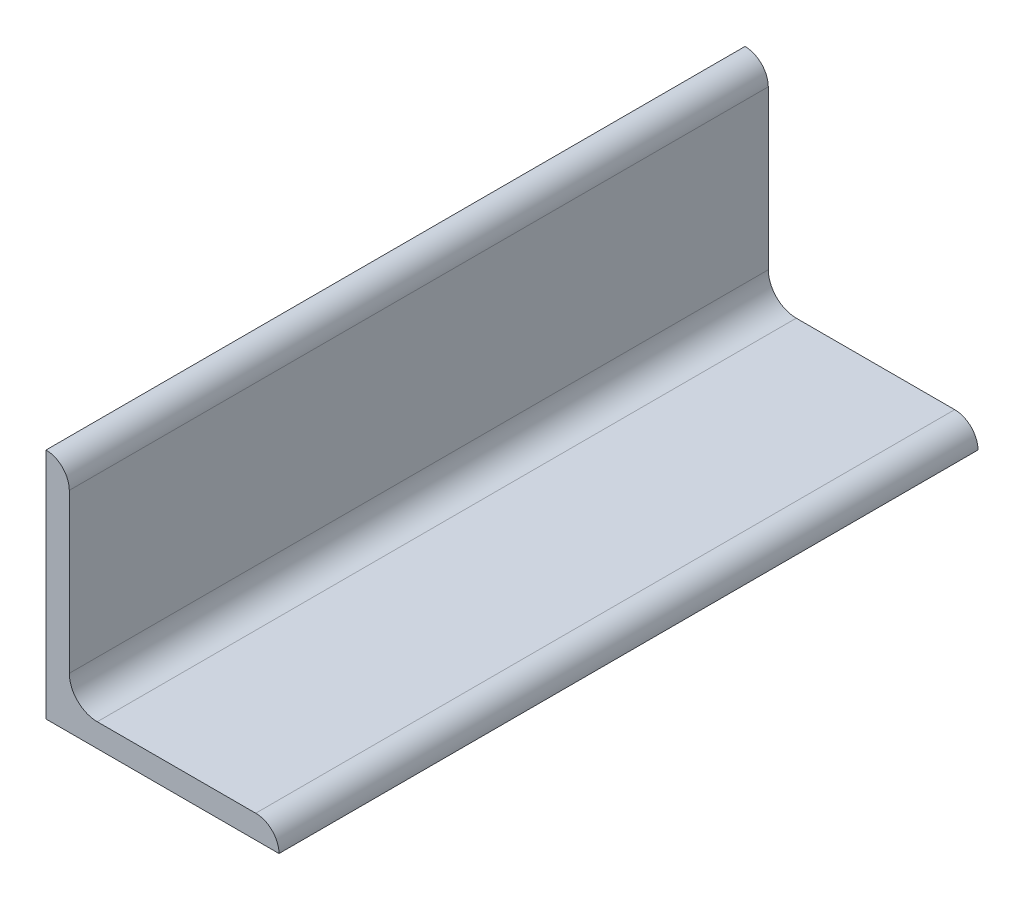
ISO-10303-21;
HEADER;
FILE_DESCRIPTION(('STEP AP214'),'2;1');
FILE_NAME('part.step','',(''),(''),'','','');
FILE_SCHEMA(('AUTOMOTIVE_DESIGN { 1 0 10303 214 1 1 1 1 }'));
ENDSEC;
DATA;
#1=APPLICATION_CONTEXT('core data for automotive mechanical design processes');
#2=APPLICATION_PROTOCOL_DEFINITION('international standard','automotive_design',2000,#1);
#3=PRODUCT_CONTEXT('',#1,'mechanical');
#4=PRODUCT('Part','Part','',(#3));
#5=PRODUCT_RELATED_PRODUCT_CATEGORY('part','',(#4));
#6=PRODUCT_DEFINITION_FORMATION('','',#4);
#7=PRODUCT_DEFINITION_CONTEXT('part definition',#1,'design');
#8=PRODUCT_DEFINITION('design','',#6,#7);
#9=PRODUCT_DEFINITION_SHAPE('','',#8);
#10=(LENGTH_UNIT() NAMED_UNIT(*) SI_UNIT(.MILLI.,.METRE.));
#11=(NAMED_UNIT(*) PLANE_ANGLE_UNIT() SI_UNIT($,.RADIAN.));
#12=(NAMED_UNIT(*) SI_UNIT($,.STERADIAN.) SOLID_ANGLE_UNIT());
#13=UNCERTAINTY_MEASURE_WITH_UNIT(LENGTH_MEASURE(1.E-05),#10,'distance_accuracy_value','');
#14=(GEOMETRIC_REPRESENTATION_CONTEXT(3) GLOBAL_UNCERTAINTY_ASSIGNED_CONTEXT((#13)) GLOBAL_UNIT_ASSIGNED_CONTEXT((#10,
#11,#12)) REPRESENTATION_CONTEXT('',''));
#15=CARTESIAN_POINT('',(0.,0.,0.));
#16=DIRECTION('',(0.,0.,1.));
#17=DIRECTION('',(1.,0.,0.));
#18=AXIS2_PLACEMENT_3D('',#15,#16,#17);
#19=CARTESIAN_POINT('',(100.,0.,150.));
#20=DIRECTION('',(0.,1.,0.));
#21=DIRECTION('',(-1.,0.,0.));
#22=AXIS2_PLACEMENT_3D('',#19,#20,#21);
#23=PLANE('',#22);
#24=DIRECTION('',(1.,0.,0.));
#25=VECTOR('',#24,1.);
#26=CARTESIAN_POINT('',(100.,0.,-150.));
#27=LINE('',#26,#25);
#28=CARTESIAN_POINT('',(0.,0.,-150.));
#29=VERTEX_POINT('',#28);
#30=CARTESIAN_POINT('',(100.,0.,-150.));
#31=VERTEX_POINT('',#30);
#32=EDGE_CURVE('E108',#29,#31,#27,.T.);
#33=ORIENTED_EDGE('',*,*,#32,.T.);
#34=DIRECTION('',(0.,0.,-1.));
#35=VECTOR('',#34,1.);
#36=CARTESIAN_POINT('',(100.,0.,150.));
#37=LINE('',#36,#35);
#38=CARTESIAN_POINT('',(100.,0.,150.));
#39=VERTEX_POINT('',#38);
#40=EDGE_CURVE('E106',#39,#31,#37,.T.);
#41=ORIENTED_EDGE('',*,*,#40,.F.);
#42=DIRECTION('',(1.,0.,0.));
#43=VECTOR('',#42,1.);
#44=CARTESIAN_POINT('',(100.,0.,150.));
#45=LINE('',#44,#43);
#46=CARTESIAN_POINT('',(0.,0.,150.));
#47=VERTEX_POINT('',#46);
#48=EDGE_CURVE('E93',#47,#39,#45,.T.);
#49=ORIENTED_EDGE('',*,*,#48,.F.);
#50=DIRECTION('',(0.,0.,-1.));
#51=VECTOR('',#50,1.);
#52=CARTESIAN_POINT('',(0.,0.,150.));
#53=LINE('',#52,#51);
#54=EDGE_CURVE('E128',#47,#29,#53,.T.);
#55=ORIENTED_EDGE('',*,*,#54,.T.);
#56=EDGE_LOOP('',(#33,#41,#49,#55));
#57=FACE_BOUND('',#56,.T.);
#58=ADVANCED_FACE('F34',(#57),#23,.F.);
#59=CARTESIAN_POINT('',(22.,9.99999999999999,150.));
#60=DIRECTION('',(0.,-1.,0.));
#61=DIRECTION('',(0.,0.,-1.));
#62=AXIS2_PLACEMENT_3D('',#59,#60,#61);
#63=PLANE('',#62);
#64=DIRECTION('',(-1.,0.,0.));
#65=VECTOR('',#64,1.);
#66=CARTESIAN_POINT('',(22.,9.99999999999999,150.));
#67=LINE('',#66,#65);
#68=CARTESIAN_POINT('',(90.,9.99999999999999,150.));
#69=VERTEX_POINT('',#68);
#70=CARTESIAN_POINT('',(22.,9.99999999999999,150.));
#71=VERTEX_POINT('',#70);
#72=EDGE_CURVE('E101',#69,#71,#67,.T.);
#73=ORIENTED_EDGE('',*,*,#72,.F.);
#74=DIRECTION('',(0.,0.,-1.));
#75=VECTOR('',#74,1.);
#76=CARTESIAN_POINT('',(90.,9.99999999999999,150.));
#77=LINE('',#76,#75);
#78=CARTESIAN_POINT('',(90.,9.99999999999999,-150.));
#79=VERTEX_POINT('',#78);
#80=EDGE_CURVE('E11',#69,#79,#77,.T.);
#81=ORIENTED_EDGE('',*,*,#80,.T.);
#82=DIRECTION('',(-1.,0.,0.));
#83=VECTOR('',#82,1.);
#84=CARTESIAN_POINT('',(22.,9.99999999999999,-150.));
#85=LINE('',#84,#83);
#86=CARTESIAN_POINT('',(22.,9.99999999999999,-150.));
#87=VERTEX_POINT('',#86);
#88=EDGE_CURVE('E135',#79,#87,#85,.T.);
#89=ORIENTED_EDGE('',*,*,#88,.T.);
#90=DIRECTION('',(0.,0.,-1.));
#91=VECTOR('',#90,1.);
#92=CARTESIAN_POINT('',(22.,9.99999999999999,150.));
#93=LINE('',#92,#91);
#94=EDGE_CURVE('E111',#71,#87,#93,.T.);
#95=ORIENTED_EDGE('',*,*,#94,.F.);
#96=EDGE_LOOP('',(#73,#81,#89,#95));
#97=FACE_BOUND('',#96,.T.);
#98=ADVANCED_FACE('F147',(#97),#63,.F.);
#99=CARTESIAN_POINT('',(22.,22.,150.));
#100=DIRECTION('',(0.,0.,-1.));
#101=DIRECTION('',(-1.,0.,0.));
#102=AXIS2_PLACEMENT_3D('',#99,#100,#101);
#103=CYLINDRICAL_SURFACE('',#102,12.);
#104=CARTESIAN_POINT('',(22.,22.,-150.));
#105=DIRECTION('',(0.,0.,-1.));
#106=DIRECTION('',(-1.,0.,0.));
#107=AXIS2_PLACEMENT_3D('',#104,#105,#106);
#108=CIRCLE('',#107,12.);
#109=CARTESIAN_POINT('',(10.,22.,-150.));
#110=VERTEX_POINT('',#109);
#111=EDGE_CURVE('E133',#87,#110,#108,.T.);
#112=ORIENTED_EDGE('',*,*,#111,.T.);
#113=DIRECTION('',(0.,0.,-1.));
#114=VECTOR('',#113,1.);
#115=CARTESIAN_POINT('',(10.,22.,150.));
#116=LINE('',#115,#114);
#117=CARTESIAN_POINT('',(10.,22.,150.));
#118=VERTEX_POINT('',#117);
#119=EDGE_CURVE('E122',#118,#110,#116,.T.);
#120=ORIENTED_EDGE('',*,*,#119,.F.);
#121=CARTESIAN_POINT('',(22.,22.,150.));
#122=DIRECTION('',(0.,0.,-1.));
#123=DIRECTION('',(-1.,0.,0.));
#124=AXIS2_PLACEMENT_3D('',#121,#122,#123);
#125=CIRCLE('',#124,12.);
#126=EDGE_CURVE('E141',#71,#118,#125,.T.);
#127=ORIENTED_EDGE('',*,*,#126,.F.);
#128=ORIENTED_EDGE('',*,*,#94,.T.);
#129=EDGE_LOOP('',(#112,#120,#127,#128));
#130=FACE_BOUND('',#129,.T.);
#131=ADVANCED_FACE('F151',(#130),#103,.F.);
#132=CARTESIAN_POINT('',(9.99999999999999,100.,150.));
#133=DIRECTION('',(-1.,0.,0.));
#134=DIRECTION('',(0.,-1.,0.));
#135=AXIS2_PLACEMENT_3D('',#132,#133,#134);
#136=PLANE('',#135);
#137=DIRECTION('',(0.,1.,0.));
#138=VECTOR('',#137,1.);
#139=CARTESIAN_POINT('',(9.99999999999999,100.,-150.));
#140=LINE('',#139,#138);
#141=CARTESIAN_POINT('',(10.,90.,-150.));
#142=VERTEX_POINT('',#141);
#143=EDGE_CURVE('E131',#110,#142,#140,.T.);
#144=ORIENTED_EDGE('',*,*,#143,.T.);
#145=DIRECTION('',(0.,0.,-1.));
#146=VECTOR('',#145,1.);
#147=CARTESIAN_POINT('',(10.,90.,150.));
#148=LINE('',#147,#146);
#149=CARTESIAN_POINT('',(10.,90.,150.));
#150=VERTEX_POINT('',#149);
#151=EDGE_CURVE('E57',#142,#150,#148,.F.);
#152=ORIENTED_EDGE('',*,*,#151,.T.);
#153=DIRECTION('',(0.,1.,0.));
#154=VECTOR('',#153,1.);
#155=CARTESIAN_POINT('',(9.99999999999999,100.,150.));
#156=LINE('',#155,#154);
#157=EDGE_CURVE('E139',#118,#150,#156,.T.);
#158=ORIENTED_EDGE('',*,*,#157,.F.);
#159=ORIENTED_EDGE('',*,*,#119,.T.);
#160=EDGE_LOOP('',(#144,#152,#158,#159));
#161=FACE_BOUND('',#160,.T.);
#162=ADVANCED_FACE('F153',(#161),#136,.F.);
#163=CARTESIAN_POINT('',(0.,100.,150.));
#164=DIRECTION('',(1.,0.,0.));
#165=DIRECTION('',(0.,1.,0.));
#166=AXIS2_PLACEMENT_3D('',#163,#164,#165);
#167=PLANE('',#166);
#168=DIRECTION('',(0.,-1.,0.));
#169=VECTOR('',#168,1.);
#170=CARTESIAN_POINT('',(0.,100.,-150.));
#171=LINE('',#170,#169);
#172=CARTESIAN_POINT('',(0.,100.,-150.));
#173=VERTEX_POINT('',#172);
#174=EDGE_CURVE('E102',#173,#29,#171,.T.);
#175=ORIENTED_EDGE('',*,*,#174,.T.);
#176=ORIENTED_EDGE('',*,*,#54,.F.);
#177=DIRECTION('',(0.,-1.,0.));
#178=VECTOR('',#177,1.);
#179=CARTESIAN_POINT('',(0.,100.,150.));
#180=LINE('',#179,#178);
#181=CARTESIAN_POINT('',(0.,100.,150.));
#182=VERTEX_POINT('',#181);
#183=EDGE_CURVE('E97',#182,#47,#180,.T.);
#184=ORIENTED_EDGE('',*,*,#183,.F.);
#185=DIRECTION('',(0.,0.,-1.));
#186=VECTOR('',#185,1.);
#187=CARTESIAN_POINT('',(0.,100.,150.));
#188=LINE('',#187,#186);
#189=EDGE_CURVE('E125',#182,#173,#188,.T.);
#190=ORIENTED_EDGE('',*,*,#189,.T.);
#191=EDGE_LOOP('',(#175,#176,#184,#190));
#192=FACE_BOUND('',#191,.T.);
#193=ADVANCED_FACE('F160',(#192),#167,.F.);
#194=CARTESIAN_POINT('',(22.,22.,150.));
#195=DIRECTION('',(0.,0.,-1.));
#196=DIRECTION('',(-1.,0.,0.));
#197=AXIS2_PLACEMENT_3D('',#194,#195,#196);
#198=PLANE('',#197);
#199=ORIENTED_EDGE('',*,*,#157,.T.);
#200=CARTESIAN_POINT('',(0.,90.,150.));
#201=DIRECTION('',(0.,0.,-1.));
#202=DIRECTION('',(-1.,0.,0.));
#203=AXIS2_PLACEMENT_3D('',#200,#201,#202);
#204=CIRCLE('',#203,10.);
#205=EDGE_CURVE('E42',#150,#182,#204,.F.);
#206=ORIENTED_EDGE('',*,*,#205,.T.);
#207=ORIENTED_EDGE('',*,*,#183,.T.);
#208=ORIENTED_EDGE('',*,*,#48,.T.);
#209=CARTESIAN_POINT('',(90.,0.,150.));
#210=DIRECTION('',(0.,0.,-1.));
#211=DIRECTION('',(-1.,0.,0.));
#212=AXIS2_PLACEMENT_3D('',#209,#210,#211);
#213=CIRCLE('',#212,10.);
#214=EDGE_CURVE('E49',#39,#69,#213,.F.);
#215=ORIENTED_EDGE('',*,*,#214,.T.);
#216=ORIENTED_EDGE('',*,*,#72,.T.);
#217=ORIENTED_EDGE('',*,*,#126,.T.);
#218=EDGE_LOOP('',(#199,#206,#207,#208,#215,#216,#217));
#219=FACE_BOUND('',#218,.T.);
#220=ADVANCED_FACE('F95',(#219),#198,.F.);
#221=CARTESIAN_POINT('',(22.,22.,-150.));
#222=DIRECTION('',(0.,0.,-1.));
#223=DIRECTION('',(-1.,0.,0.));
#224=AXIS2_PLACEMENT_3D('',#221,#222,#223);
#225=PLANE('',#224);
#226=ORIENTED_EDGE('',*,*,#174,.F.);
#227=CARTESIAN_POINT('',(0.,90.,-150.));
#228=DIRECTION('',(0.,0.,-1.));
#229=DIRECTION('',(-1.,0.,0.));
#230=AXIS2_PLACEMENT_3D('',#227,#228,#229);
#231=CIRCLE('',#230,10.);
#232=EDGE_CURVE('E115',#173,#142,#231,.T.);
#233=ORIENTED_EDGE('',*,*,#232,.T.);
#234=ORIENTED_EDGE('',*,*,#143,.F.);
#235=ORIENTED_EDGE('',*,*,#111,.F.);
#236=ORIENTED_EDGE('',*,*,#88,.F.);
#237=CARTESIAN_POINT('',(90.,0.,-150.));
#238=DIRECTION('',(0.,0.,-1.));
#239=DIRECTION('',(-1.,0.,0.));
#240=AXIS2_PLACEMENT_3D('',#237,#238,#239);
#241=CIRCLE('',#240,10.);
#242=EDGE_CURVE('E110',#79,#31,#241,.T.);
#243=ORIENTED_EDGE('',*,*,#242,.T.);
#244=ORIENTED_EDGE('',*,*,#32,.F.);
#245=EDGE_LOOP('',(#226,#233,#234,#235,#236,#243,#244));
#246=FACE_BOUND('',#245,.T.);
#247=ADVANCED_FACE('F162',(#246),#225,.T.);
#248=CARTESIAN_POINT('',(0.,90.,150.));
#249=DIRECTION('',(0.,0.,-1.));
#250=DIRECTION('',(-1.,0.,0.));
#251=AXIS2_PLACEMENT_3D('',#248,#249,#250);
#252=CYLINDRICAL_SURFACE('',#251,10.);
#253=ORIENTED_EDGE('',*,*,#205,.F.);
#254=ORIENTED_EDGE('',*,*,#151,.F.);
#255=ORIENTED_EDGE('',*,*,#232,.F.);
#256=ORIENTED_EDGE('',*,*,#189,.F.);
#257=EDGE_LOOP('',(#253,#254,#255,#256));
#258=FACE_BOUND('',#257,.T.);
#259=ADVANCED_FACE('F157',(#258),#252,.T.);
#260=CARTESIAN_POINT('',(90.,0.,150.));
#261=DIRECTION('',(0.,0.,-1.));
#262=DIRECTION('',(-1.,0.,0.));
#263=AXIS2_PLACEMENT_3D('',#260,#261,#262);
#264=CYLINDRICAL_SURFACE('',#263,10.);
#265=ORIENTED_EDGE('',*,*,#214,.F.);
#266=ORIENTED_EDGE('',*,*,#40,.T.);
#267=ORIENTED_EDGE('',*,*,#242,.F.);
#268=ORIENTED_EDGE('',*,*,#80,.F.);
#269=EDGE_LOOP('',(#265,#266,#267,#268));
#270=FACE_BOUND('',#269,.T.);
#271=ADVANCED_FACE('F36',(#270),#264,.T.);
#272=CLOSED_SHELL('',(#58,#98,#131,#162,#193,#220,#247,#259,#271));
#273=MANIFOLD_SOLID_BREP('B2',#272);
#274=ADVANCED_BREP_SHAPE_REPRESENTATION('',(#18,#273),#14);
#275=SHAPE_DEFINITION_REPRESENTATION(#9,#274);
ENDSEC;
END-ISO-10303-21;
